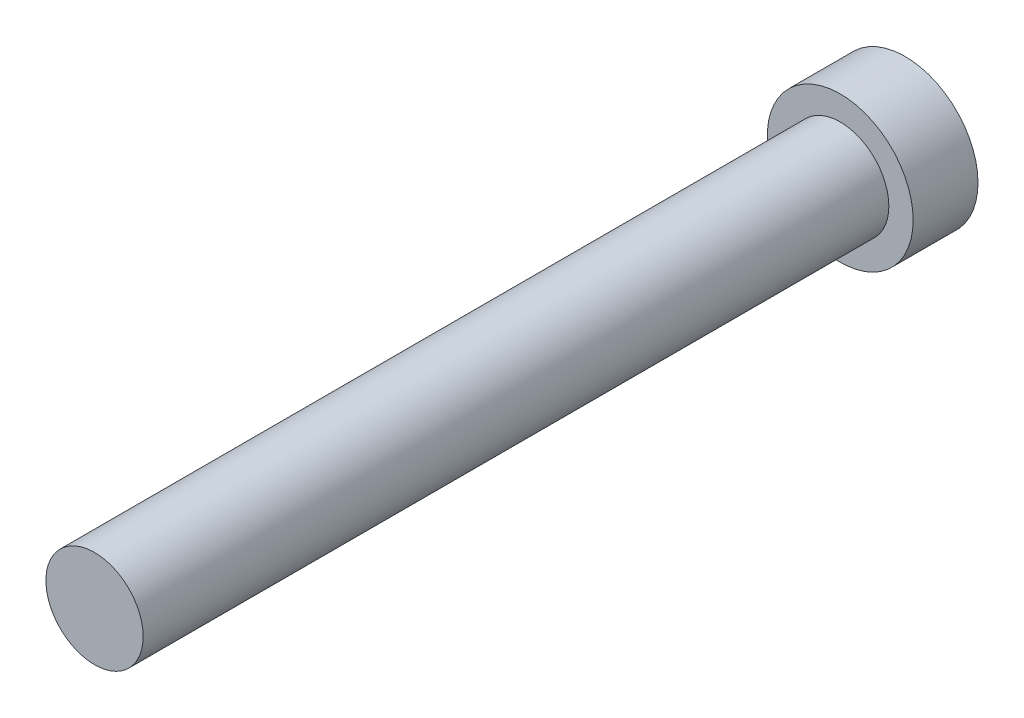
ISO-10303-21;
HEADER;
FILE_DESCRIPTION(('STEP AP214'),'2;1');
FILE_NAME('part.step','',(''),(''),'','','');
FILE_SCHEMA(('AUTOMOTIVE_DESIGN { 1 0 10303 214 1 1 1 1 }'));
ENDSEC;
DATA;
#1=APPLICATION_CONTEXT('core data for automotive mechanical design processes');
#2=APPLICATION_PROTOCOL_DEFINITION('international standard','automotive_design',2000,#1);
#3=PRODUCT_CONTEXT('',#1,'mechanical');
#4=PRODUCT('Part','Part','',(#3));
#5=PRODUCT_RELATED_PRODUCT_CATEGORY('part','',(#4));
#6=PRODUCT_DEFINITION_FORMATION('','',#4);
#7=PRODUCT_DEFINITION_CONTEXT('part definition',#1,'design');
#8=PRODUCT_DEFINITION('design','',#6,#7);
#9=PRODUCT_DEFINITION_SHAPE('','',#8);
#10=(LENGTH_UNIT() NAMED_UNIT(*) SI_UNIT(.MILLI.,.METRE.));
#11=(NAMED_UNIT(*) PLANE_ANGLE_UNIT() SI_UNIT($,.RADIAN.));
#12=(NAMED_UNIT(*) SI_UNIT($,.STERADIAN.) SOLID_ANGLE_UNIT());
#13=UNCERTAINTY_MEASURE_WITH_UNIT(LENGTH_MEASURE(1.E-05),#10,'distance_accuracy_value','');
#14=(GEOMETRIC_REPRESENTATION_CONTEXT(3) GLOBAL_UNCERTAINTY_ASSIGNED_CONTEXT((#13)) GLOBAL_UNIT_ASSIGNED_CONTEXT((#10,
#11,#12)) REPRESENTATION_CONTEXT('',''));
#15=CARTESIAN_POINT('',(0.,0.,0.));
#16=DIRECTION('',(0.,0.,1.));
#17=DIRECTION('',(1.,0.,0.));
#18=AXIS2_PLACEMENT_3D('',#15,#16,#17);
#19=CARTESIAN_POINT('',(0.,0.,20.));
#20=DIRECTION('',(0.,0.,-1.));
#21=DIRECTION('',(-1.,0.,0.));
#22=AXIS2_PLACEMENT_3D('',#19,#20,#21);
#23=CYLINDRICAL_SURFACE('',#22,22.5);
#24=CARTESIAN_POINT('',(0.,0.,20.));
#25=DIRECTION('',(0.,0.,1.));
#26=DIRECTION('',(1.,0.,0.));
#27=AXIS2_PLACEMENT_3D('',#24,#25,#26);
#28=CIRCLE('',#27,22.5);
#29=CARTESIAN_POINT('',(22.5,0.,20.));
#30=VERTEX_POINT('',#29);
#31=EDGE_CURVE('E51',#30,#30,#28,.T.);
#32=ORIENTED_EDGE('',*,*,#31,.F.);
#33=EDGE_LOOP('',(#32));
#34=FACE_BOUND('',#33,.T.);
#35=CARTESIAN_POINT('',(0.,0.,0.));
#36=DIRECTION('',(0.,0.,1.));
#37=DIRECTION('',(1.,0.,0.));
#38=AXIS2_PLACEMENT_3D('',#35,#36,#37);
#39=CIRCLE('',#38,22.5);
#40=CARTESIAN_POINT('',(22.5,0.,0.));
#41=VERTEX_POINT('',#40);
#42=EDGE_CURVE('E46',#41,#41,#39,.T.);
#43=ORIENTED_EDGE('',*,*,#42,.T.);
#44=EDGE_LOOP('',(#43));
#45=FACE_BOUND('',#44,.T.);
#46=ADVANCED_FACE('F43',(#34,#45),#23,.T.);
#47=CARTESIAN_POINT('',(0.,0.,20.));
#48=DIRECTION('',(0.,0.,1.));
#49=DIRECTION('',(1.,0.,0.));
#50=AXIS2_PLACEMENT_3D('',#47,#48,#49);
#51=PLANE('',#50);
#52=CARTESIAN_POINT('',(0.,0.,20.));
#53=DIRECTION('',(0.,0.,1.));
#54=DIRECTION('',(1.,0.,0.));
#55=AXIS2_PLACEMENT_3D('',#52,#53,#54);
#56=CIRCLE('',#55,15.);
#57=CARTESIAN_POINT('',(15.,0.,20.));
#58=VERTEX_POINT('',#57);
#59=EDGE_CURVE('E10',#58,#58,#56,.T.);
#60=ORIENTED_EDGE('',*,*,#59,.F.);
#61=EDGE_LOOP('',(#60));
#62=FACE_BOUND('',#61,.T.);
#63=ORIENTED_EDGE('',*,*,#31,.T.);
#64=EDGE_LOOP('',(#63));
#65=FACE_BOUND('',#64,.T.);
#66=ADVANCED_FACE('F71',(#62,#65),#51,.T.);
#67=CARTESIAN_POINT('',(0.,0.,0.));
#68=DIRECTION('',(0.,0.,1.));
#69=DIRECTION('',(1.,0.,0.));
#70=AXIS2_PLACEMENT_3D('',#67,#68,#69);
#71=PLANE('',#70);
#72=ORIENTED_EDGE('',*,*,#42,.F.);
#73=EDGE_LOOP('',(#72));
#74=FACE_BOUND('',#73,.T.);
#75=ADVANCED_FACE('F68',(#74),#71,.F.);
#76=CARTESIAN_POINT('',(0.,0.,250.));
#77=DIRECTION('',(0.,0.,-1.));
#78=DIRECTION('',(-1.,0.,0.));
#79=AXIS2_PLACEMENT_3D('',#76,#77,#78);
#80=CYLINDRICAL_SURFACE('',#79,15.);
#81=CARTESIAN_POINT('',(0.,0.,250.));
#82=DIRECTION('',(0.,0.,1.));
#83=DIRECTION('',(1.,0.,0.));
#84=AXIS2_PLACEMENT_3D('',#81,#82,#83);
#85=CIRCLE('',#84,15.);
#86=CARTESIAN_POINT('',(15.,0.,250.));
#87=VERTEX_POINT('',#86);
#88=EDGE_CURVE('E58',#87,#87,#85,.T.);
#89=ORIENTED_EDGE('',*,*,#88,.F.);
#90=EDGE_LOOP('',(#89));
#91=FACE_BOUND('',#90,.T.);
#92=ORIENTED_EDGE('',*,*,#59,.T.);
#93=EDGE_LOOP('',(#92));
#94=FACE_BOUND('',#93,.T.);
#95=ADVANCED_FACE('F70',(#91,#94),#80,.T.);
#96=CARTESIAN_POINT('',(0.,0.,250.));
#97=DIRECTION('',(0.,0.,1.));
#98=DIRECTION('',(1.,0.,0.));
#99=AXIS2_PLACEMENT_3D('',#96,#97,#98);
#100=PLANE('',#99);
#101=ORIENTED_EDGE('',*,*,#88,.T.);
#102=EDGE_LOOP('',(#101));
#103=FACE_BOUND('',#102,.T.);
#104=ADVANCED_FACE('F75',(#103),#100,.T.);
#105=CLOSED_SHELL('',(#46,#66,#75,#95,#104));
#106=MANIFOLD_SOLID_BREP('B2',#105);
#107=ADVANCED_BREP_SHAPE_REPRESENTATION('',(#18,#106),#14);
#108=SHAPE_DEFINITION_REPRESENTATION(#9,#107);
ENDSEC;
END-ISO-10303-21;
